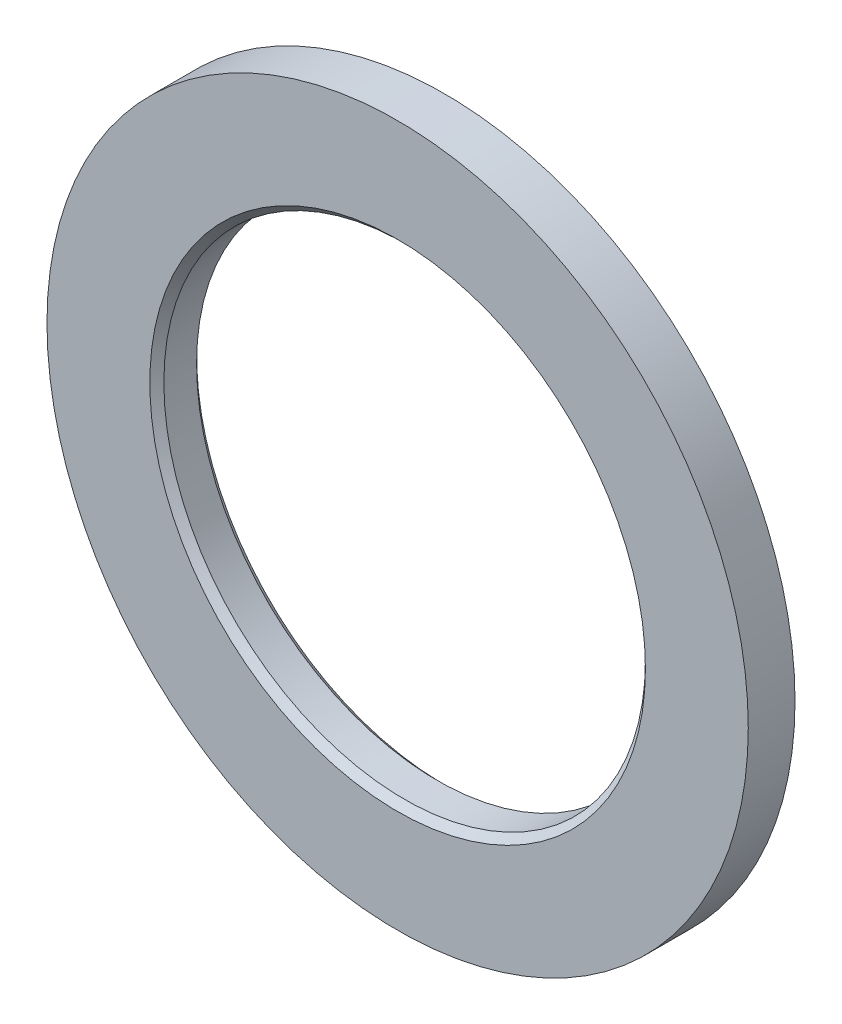
ISO-10303-21;
HEADER;
FILE_DESCRIPTION(('STEP AP214'),'2;1');
FILE_NAME('part.step','',(''),(''),'','','');
FILE_SCHEMA(('AUTOMOTIVE_DESIGN { 1 0 10303 214 1 1 1 1 }'));
ENDSEC;
DATA;
#1=APPLICATION_CONTEXT('core data for automotive mechanical design processes');
#2=APPLICATION_PROTOCOL_DEFINITION('international standard','automotive_design',2000,#1);
#3=PRODUCT_CONTEXT('',#1,'mechanical');
#4=PRODUCT('Part','Part','',(#3));
#5=PRODUCT_RELATED_PRODUCT_CATEGORY('part','',(#4));
#6=PRODUCT_DEFINITION_FORMATION('','',#4);
#7=PRODUCT_DEFINITION_CONTEXT('part definition',#1,'design');
#8=PRODUCT_DEFINITION('design','',#6,#7);
#9=PRODUCT_DEFINITION_SHAPE('','',#8);
#10=(LENGTH_UNIT() NAMED_UNIT(*) SI_UNIT(.MILLI.,.METRE.));
#11=(NAMED_UNIT(*) PLANE_ANGLE_UNIT() SI_UNIT($,.RADIAN.));
#12=(NAMED_UNIT(*) SI_UNIT($,.STERADIAN.) SOLID_ANGLE_UNIT());
#13=UNCERTAINTY_MEASURE_WITH_UNIT(LENGTH_MEASURE(1.E-05),#10,'distance_accuracy_value','');
#14=(GEOMETRIC_REPRESENTATION_CONTEXT(3) GLOBAL_UNCERTAINTY_ASSIGNED_CONTEXT((#13)) GLOBAL_UNIT_ASSIGNED_CONTEXT((#10,
#11,#12)) REPRESENTATION_CONTEXT('',''));
#15=CARTESIAN_POINT('',(0.,0.,0.));
#16=DIRECTION('',(0.,0.,1.));
#17=DIRECTION('',(1.,0.,0.));
#18=AXIS2_PLACEMENT_3D('',#15,#16,#17);
#19=CARTESIAN_POINT('',(0.,0.,5.));
#20=DIRECTION('',(0.,0.,-1.));
#21=DIRECTION('',(-1.,0.,0.));
#22=AXIS2_PLACEMENT_3D('',#19,#20,#21);
#23=CYLINDRICAL_SURFACE('',#22,37.5);
#24=CARTESIAN_POINT('',(0.,0.,5.));
#25=DIRECTION('',(0.,0.,1.));
#26=DIRECTION('',(1.,0.,0.));
#27=AXIS2_PLACEMENT_3D('',#24,#25,#26);
#28=CIRCLE('',#27,37.5);
#29=CARTESIAN_POINT('',(37.5,0.,5.));
#30=VERTEX_POINT('',#29);
#31=EDGE_CURVE('E10',#30,#30,#28,.T.);
#32=ORIENTED_EDGE('',*,*,#31,.F.);
#33=EDGE_LOOP('',(#32));
#34=FACE_BOUND('',#33,.T.);
#35=CARTESIAN_POINT('',(0.,0.,0.));
#36=DIRECTION('',(0.,0.,1.));
#37=DIRECTION('',(1.,0.,0.));
#38=AXIS2_PLACEMENT_3D('',#35,#36,#37);
#39=CIRCLE('',#38,37.5);
#40=CARTESIAN_POINT('',(37.5,0.,0.));
#41=VERTEX_POINT('',#40);
#42=EDGE_CURVE('E36',#41,#41,#39,.T.);
#43=ORIENTED_EDGE('',*,*,#42,.T.);
#44=EDGE_LOOP('',(#43));
#45=FACE_BOUND('',#44,.T.);
#46=ADVANCED_FACE('F33',(#34,#45),#23,.T.);
#47=CARTESIAN_POINT('',(0.,0.,5.));
#48=DIRECTION('',(0.,0.,1.));
#49=DIRECTION('',(1.,0.,0.));
#50=AXIS2_PLACEMENT_3D('',#47,#48,#49);
#51=PLANE('',#50);
#52=CARTESIAN_POINT('',(0.,0.,5.));
#53=DIRECTION('',(0.,0.,1.));
#54=DIRECTION('',(1.,0.,0.));
#55=AXIS2_PLACEMENT_3D('',#52,#53,#54);
#56=CIRCLE('',#55,26.5);
#57=CARTESIAN_POINT('',(26.5,0.,5.));
#58=VERTEX_POINT('',#57);
#59=EDGE_CURVE('E43',#58,#58,#56,.T.);
#60=ORIENTED_EDGE('',*,*,#59,.F.);
#61=EDGE_LOOP('',(#60));
#62=FACE_BOUND('',#61,.T.);
#63=ORIENTED_EDGE('',*,*,#31,.T.);
#64=EDGE_LOOP('',(#63));
#65=FACE_BOUND('',#64,.T.);
#66=ADVANCED_FACE('F78',(#62,#65),#51,.T.);
#67=CARTESIAN_POINT('',(0.,0.,0.));
#68=DIRECTION('',(0.,0.,1.));
#69=DIRECTION('',(1.,0.,0.));
#70=AXIS2_PLACEMENT_3D('',#67,#68,#69);
#71=PLANE('',#70);
#72=CARTESIAN_POINT('',(0.,0.,0.));
#73=DIRECTION('',(0.,0.,1.));
#74=DIRECTION('',(1.,0.,0.));
#75=AXIS2_PLACEMENT_3D('',#72,#73,#74);
#76=CIRCLE('',#75,26.5);
#77=CARTESIAN_POINT('',(26.5,0.,0.));
#78=VERTEX_POINT('',#77);
#79=EDGE_CURVE('E53',#78,#78,#76,.T.);
#80=ORIENTED_EDGE('',*,*,#79,.T.);
#81=EDGE_LOOP('',(#80));
#82=FACE_BOUND('',#81,.T.);
#83=ORIENTED_EDGE('',*,*,#42,.F.);
#84=EDGE_LOOP('',(#83));
#85=FACE_BOUND('',#84,.T.);
#86=ADVANCED_FACE('F57',(#82,#85),#71,.F.);
#87=CARTESIAN_POINT('',(0.,0.,0.));
#88=DIRECTION('',(0.,0.,1.));
#89=DIRECTION('',(1.,0.,0.));
#90=AXIS2_PLACEMENT_3D('',#87,#88,#89);
#91=CYLINDRICAL_SURFACE('',#90,25.75);
#92=CARTESIAN_POINT('',(0.,0.,0.750000000000001));
#93=DIRECTION('',(0.,0.,1.));
#94=DIRECTION('',(1.,0.,0.));
#95=AXIS2_PLACEMENT_3D('',#92,#93,#94);
#96=CIRCLE('',#95,25.75);
#97=CARTESIAN_POINT('',(25.75,0.,0.750000000000001));
#98=VERTEX_POINT('',#97);
#99=EDGE_CURVE('E50',#98,#98,#96,.T.);
#100=ORIENTED_EDGE('',*,*,#99,.F.);
#101=EDGE_LOOP('',(#100));
#102=FACE_BOUND('',#101,.T.);
#103=CARTESIAN_POINT('',(0.,0.,4.25));
#104=DIRECTION('',(0.,0.,1.));
#105=DIRECTION('',(1.,0.,0.));
#106=AXIS2_PLACEMENT_3D('',#103,#104,#105);
#107=CIRCLE('',#106,25.75);
#108=CARTESIAN_POINT('',(25.75,0.,4.25));
#109=VERTEX_POINT('',#108);
#110=EDGE_CURVE('E47',#109,#109,#107,.T.);
#111=ORIENTED_EDGE('',*,*,#110,.T.);
#112=EDGE_LOOP('',(#111));
#113=FACE_BOUND('',#112,.T.);
#114=ADVANCED_FACE('F67',(#102,#113),#91,.F.);
#115=CARTESIAN_POINT('',(0.,0.,5.));
#116=DIRECTION('',(0.,0.,1.));
#117=DIRECTION('',(1.,0.,0.));
#118=AXIS2_PLACEMENT_3D('',#115,#116,#117);
#119=CONICAL_SURFACE('',#118,26.5,0.785398163397449);
#120=ORIENTED_EDGE('',*,*,#110,.F.);
#121=EDGE_LOOP('',(#120));
#122=FACE_BOUND('',#121,.T.);
#123=ORIENTED_EDGE('',*,*,#59,.T.);
#124=EDGE_LOOP('',(#123));
#125=FACE_BOUND('',#124,.T.);
#126=ADVANCED_FACE('F63',(#122,#125),#119,.F.);
#127=CARTESIAN_POINT('',(0.,0.,0.750000000000001));
#128=DIRECTION('',(0.,0.,-1.));
#129=DIRECTION('',(-1.,0.,0.));
#130=AXIS2_PLACEMENT_3D('',#127,#128,#129);
#131=CONICAL_SURFACE('',#130,25.75,0.785398163397448);
#132=ORIENTED_EDGE('',*,*,#79,.F.);
#133=EDGE_LOOP('',(#132));
#134=FACE_BOUND('',#133,.T.);
#135=ORIENTED_EDGE('',*,*,#99,.T.);
#136=EDGE_LOOP('',(#135));
#137=FACE_BOUND('',#136,.T.);
#138=ADVANCED_FACE('F60',(#134,#137),#131,.F.);
#139=CLOSED_SHELL('',(#46,#66,#86,#114,#126,#138));
#140=MANIFOLD_SOLID_BREP('B2',#139);
#141=ADVANCED_BREP_SHAPE_REPRESENTATION('',(#18,#140),#14);
#142=SHAPE_DEFINITION_REPRESENTATION(#9,#141);
ENDSEC;
END-ISO-10303-21;
